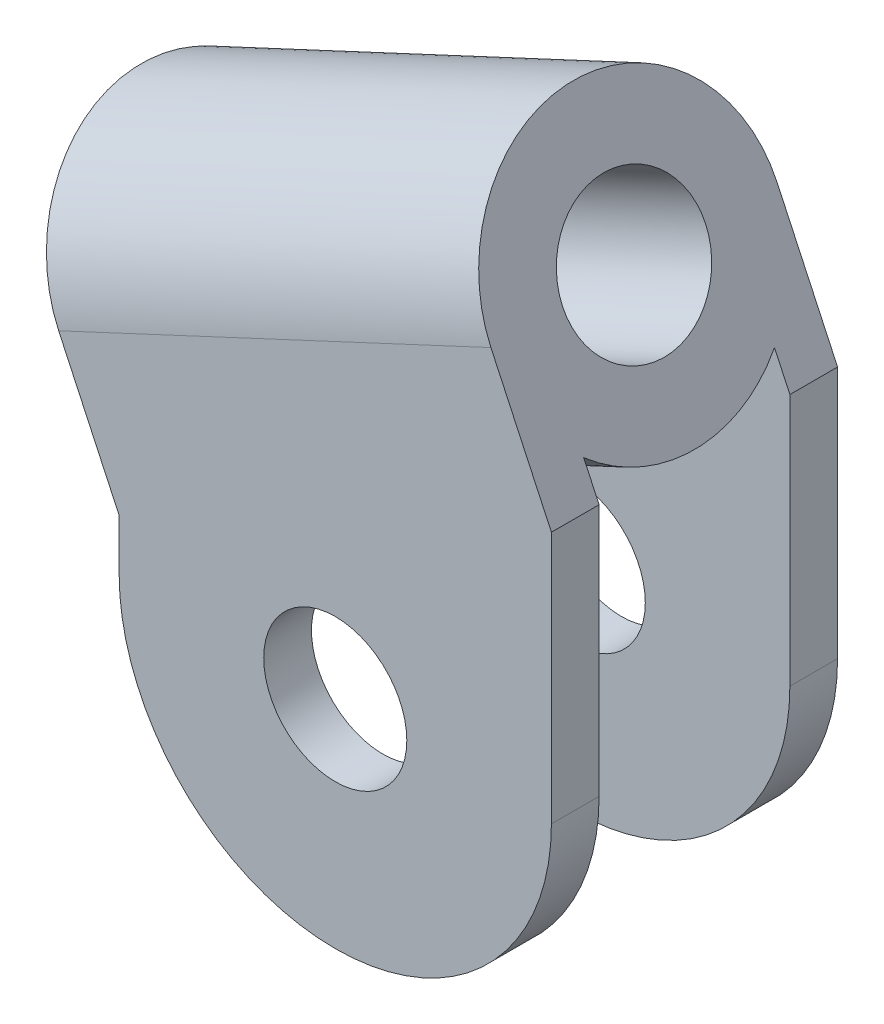
ISO-10303-21;
HEADER;
FILE_DESCRIPTION(('STEP AP214'),'2;1');
FILE_NAME('part.step','',(''),(''),'','','');
FILE_SCHEMA(('AUTOMOTIVE_DESIGN { 1 0 10303 214 1 1 1 1 }'));
ENDSEC;
DATA;
#1=APPLICATION_CONTEXT('core data for automotive mechanical design processes');
#2=APPLICATION_PROTOCOL_DEFINITION('international standard','automotive_design',2000,#1);
#3=PRODUCT_CONTEXT('',#1,'mechanical');
#4=PRODUCT('Part','Part','',(#3));
#5=PRODUCT_RELATED_PRODUCT_CATEGORY('part','',(#4));
#6=PRODUCT_DEFINITION_FORMATION('','',#4);
#7=PRODUCT_DEFINITION_CONTEXT('part definition',#1,'design');
#8=PRODUCT_DEFINITION('design','',#6,#7);
#9=PRODUCT_DEFINITION_SHAPE('','',#8);
#10=(LENGTH_UNIT() NAMED_UNIT(*) SI_UNIT(.MILLI.,.METRE.));
#11=(NAMED_UNIT(*) PLANE_ANGLE_UNIT() SI_UNIT($,.RADIAN.));
#12=(NAMED_UNIT(*) SI_UNIT($,.STERADIAN.) SOLID_ANGLE_UNIT());
#13=UNCERTAINTY_MEASURE_WITH_UNIT(LENGTH_MEASURE(1.E-05),#10,'distance_accuracy_value','');
#14=(GEOMETRIC_REPRESENTATION_CONTEXT(3) GLOBAL_UNCERTAINTY_ASSIGNED_CONTEXT((#13)) GLOBAL_UNIT_ASSIGNED_CONTEXT((#10,
#11,#12)) REPRESENTATION_CONTEXT('',''));
#15=CARTESIAN_POINT('',(0.,0.,0.));
#16=DIRECTION('',(0.,0.,1.));
#17=DIRECTION('',(1.,0.,0.));
#18=AXIS2_PLACEMENT_3D('',#15,#16,#17);
#19=CARTESIAN_POINT('',(0.,0.,0.));
#20=DIRECTION('',(-0.906307787036649,-0.422618261740701,0.));
#21=DIRECTION('',(0.422618261740701,-0.906307787036649,0.));
#22=AXIS2_PLACEMENT_3D('',#19,#20,#21);
#23=CYLINDRICAL_SURFACE('',#22,30.);
#24=DIRECTION('',(-0.906307787036649,-0.422618261740701,0.));
#25=VECTOR('',#24,1.);
#26=CARTESIAN_POINT('',(9.45003161785004,-20.2656582035135,-20.));
#27=LINE('',#26,#25);
#28=CARTESIAN_POINT('',(9.45003161785002,-20.2656582035135,-20.));
#29=VERTEX_POINT('',#28);
#30=CARTESIAN_POINT('',(100.080810321515,21.9961679705566,-20.));
#31=VERTEX_POINT('',#30);
#32=EDGE_CURVE('E148',#29,#31,#27,.F.);
#33=ORIENTED_EDGE('',*,*,#32,.T.);
#34=CARTESIAN_POINT('',(90.6307787036649,42.2618261740701,0.));
#35=DIRECTION('',(-0.906307787036649,-0.422618261740701,0.));
#36=DIRECTION('',(0.422618261740701,-0.906307787036649,0.));
#37=AXIS2_PLACEMENT_3D('',#34,#35,#36);
#38=CIRCLE('',#37,30.);
#39=CARTESIAN_POINT('',(100.080810321515,21.9961679705566,20.));
#40=VERTEX_POINT('',#39);
#41=EDGE_CURVE('E55',#31,#40,#38,.T.);
#42=ORIENTED_EDGE('',*,*,#41,.T.);
#43=DIRECTION('',(-0.906307787036649,-0.422618261740701,0.));
#44=VECTOR('',#43,1.);
#45=CARTESIAN_POINT('',(9.45003161785004,-20.2656582035135,20.));
#46=LINE('',#45,#44);
#47=CARTESIAN_POINT('',(9.45003161785002,-20.2656582035135,20.));
#48=VERTEX_POINT('',#47);
#49=EDGE_CURVE('E220',#40,#48,#46,.T.);
#50=ORIENTED_EDGE('',*,*,#49,.T.);
#51=CARTESIAN_POINT('',(0.,0.,0.));
#52=DIRECTION('',(-0.906307787036649,-0.422618261740701,0.));
#53=DIRECTION('',(0.422618261740701,-0.906307787036649,0.));
#54=AXIS2_PLACEMENT_3D('',#51,#52,#53);
#55=CIRCLE('',#54,30.);
#56=EDGE_CURVE('E63',#29,#48,#55,.T.);
#57=ORIENTED_EDGE('',*,*,#56,.F.);
#58=EDGE_LOOP('',(#33,#42,#50,#57));
#59=FACE_BOUND('',#58,.T.);
#60=ADVANCED_FACE('F45',(#59),#23,.T.);
#61=CARTESIAN_POINT('',(90.6307787036649,42.2618261740701,30.));
#62=VERTEX_POINT('',#61);
#63=CARTESIAN_POINT('',(90.6307787036649,42.2618261740701,-30.));
#64=VERTEX_POINT('',#63);
#65=EDGE_CURVE('E11',#62,#64,#38,.T.);
#66=ORIENTED_EDGE('',*,*,#65,.T.);
#67=DIRECTION('',(-0.906307787036649,-0.422618261740701,0.));
#68=VECTOR('',#67,1.);
#69=CARTESIAN_POINT('',(0.,0.,-30.));
#70=LINE('',#69,#68);
#71=CARTESIAN_POINT('',(0.,0.,-30.));
#72=VERTEX_POINT('',#71);
#73=EDGE_CURVE('E70',#72,#64,#70,.F.);
#74=ORIENTED_EDGE('',*,*,#73,.F.);
#75=CARTESIAN_POINT('',(0.,0.,30.));
#76=VERTEX_POINT('',#75);
#77=EDGE_CURVE('E161',#76,#72,#55,.T.);
#78=ORIENTED_EDGE('',*,*,#77,.F.);
#79=DIRECTION('',(-0.906307787036649,-0.422618261740701,0.));
#80=VECTOR('',#79,1.);
#81=CARTESIAN_POINT('',(0.,0.,30.));
#82=LINE('',#81,#80);
#83=EDGE_CURVE('E223',#76,#62,#82,.F.);
#84=ORIENTED_EDGE('',*,*,#83,.T.);
#85=EDGE_LOOP('',(#66,#74,#78,#84));
#86=FACE_BOUND('',#85,.T.);
#87=ADVANCED_FACE('F327',(#86),#23,.T.);
#88=CARTESIAN_POINT('',(-12.678547852221,27.1892336110994,0.));
#89=DIRECTION('',(0.906307787036649,0.422618261740701,0.));
#90=DIRECTION('',(-0.422618261740701,0.906307787036649,0.));
#91=AXIS2_PLACEMENT_3D('',#88,#89,#90);
#92=PLANE('',#91);
#93=CARTESIAN_POINT('',(0.,0.,0.));
#94=DIRECTION('',(0.906307787036649,0.422618261740701,0.));
#95=DIRECTION('',(-0.422618261740701,0.906307787036649,0.));
#96=AXIS2_PLACEMENT_3D('',#93,#94,#95);
#97=CIRCLE('',#96,15.);
#98=CARTESIAN_POINT('',(-6.33927392611052,13.5946168055497,0.));
#99=VERTEX_POINT('',#98);
#100=EDGE_CURVE('E242',#99,#99,#97,.T.);
#101=ORIENTED_EDGE('',*,*,#100,.T.);
#102=EDGE_LOOP('',(#101));
#103=FACE_BOUND('',#102,.T.);
#104=ORIENTED_EDGE('',*,*,#77,.T.);
#105=DIRECTION('',(0.422618261740701,-0.906307787036649,0.));
#106=VECTOR('',#105,1.);
#107=CARTESIAN_POINT('',(-28.8663280289911,61.9040402278701,-30.));
#108=LINE('',#107,#106);
#109=CARTESIAN_POINT('',(12.678547852221,-27.1892336110995,-30.));
#110=VERTEX_POINT('',#109);
#111=EDGE_CURVE('E147',#72,#110,#108,.T.);
#112=ORIENTED_EDGE('',*,*,#111,.T.);
#113=DIRECTION('',(0.,0.,1.));
#114=VECTOR('',#113,1.);
#115=CARTESIAN_POINT('',(12.678547852221,-27.1892336110995,-30.));
#116=LINE('',#115,#114);
#117=CARTESIAN_POINT('',(12.678547852221,-27.1892336110995,-20.));
#118=VERTEX_POINT('',#117);
#119=EDGE_CURVE('E137',#110,#118,#116,.T.);
#120=ORIENTED_EDGE('',*,*,#119,.T.);
#121=DIRECTION('',(0.422618261740701,-0.906307787036649,0.));
#122=VECTOR('',#121,1.);
#123=CARTESIAN_POINT('',(-28.8663280289911,61.9040402278701,-20.));
#124=LINE('',#123,#122);
#125=EDGE_CURVE('E163',#29,#118,#124,.T.);
#126=ORIENTED_EDGE('',*,*,#125,.F.);
#127=ORIENTED_EDGE('',*,*,#56,.T.);
#128=DIRECTION('',(0.422618261740701,-0.906307787036649,0.));
#129=VECTOR('',#128,1.);
#130=CARTESIAN_POINT('',(-28.8663280289911,61.9040402278701,20.));
#131=LINE('',#130,#129);
#132=CARTESIAN_POINT('',(12.678547852221,-27.1892336110995,20.));
#133=VERTEX_POINT('',#132);
#134=EDGE_CURVE('E214',#48,#133,#131,.T.);
#135=ORIENTED_EDGE('',*,*,#134,.T.);
#136=DIRECTION('',(0.,0.,1.));
#137=VECTOR('',#136,1.);
#138=CARTESIAN_POINT('',(12.678547852221,-27.1892336110995,20.));
#139=LINE('',#138,#137);
#140=CARTESIAN_POINT('',(12.678547852221,-27.1892336110995,30.));
#141=VERTEX_POINT('',#140);
#142=EDGE_CURVE('E209',#133,#141,#139,.T.);
#143=ORIENTED_EDGE('',*,*,#142,.T.);
#144=DIRECTION('',(0.422618261740701,-0.906307787036649,0.));
#145=VECTOR('',#144,1.);
#146=CARTESIAN_POINT('',(-28.8663280289911,61.9040402278701,30.));
#147=LINE('',#146,#145);
#148=EDGE_CURVE('E213',#76,#141,#147,.T.);
#149=ORIENTED_EDGE('',*,*,#148,.F.);
#150=EDGE_LOOP('',(#104,#112,#120,#126,#127,#135,#143,#149));
#151=FACE_BOUND('',#150,.T.);
#152=ADVANCED_FACE('F47',(#103,#151),#92,.F.);
#153=CARTESIAN_POINT('',(90.6307787036649,42.2618261740701,0.));
#154=DIRECTION('',(-0.906307787036649,-0.422618261740701,0.));
#155=DIRECTION('',(0.422618261740701,-0.906307787036649,0.));
#156=AXIS2_PLACEMENT_3D('',#153,#154,#155);
#157=PLANE('',#156);
#158=CARTESIAN_POINT('',(90.6307787036649,42.2618261740701,0.));
#159=DIRECTION('',(-0.906307787036649,-0.422618261740701,0.));
#160=DIRECTION('',(0.422618261740701,-0.906307787036649,0.));
#161=AXIS2_PLACEMENT_3D('',#158,#159,#160);
#162=CIRCLE('',#161,15.);
#163=CARTESIAN_POINT('',(96.9700526297754,28.6672093685203,0.));
#164=VERTEX_POINT('',#163);
#165=EDGE_CURVE('E239',#164,#164,#162,.T.);
#166=ORIENTED_EDGE('',*,*,#165,.T.);
#167=EDGE_LOOP('',(#166));
#168=FACE_BOUND('',#167,.T.);
#169=ORIENTED_EDGE('',*,*,#65,.F.);
#170=DIRECTION('',(0.422618261740701,-0.906307787036649,0.));
#171=VECTOR('',#170,1.);
#172=CARTESIAN_POINT('',(61.7644506746738,104.16586640194,30.));
#173=LINE('',#172,#171);
#174=CARTESIAN_POINT('',(103.309326555886,15.0725925629706,30.));
#175=VERTEX_POINT('',#174);
#176=EDGE_CURVE('E208',#62,#175,#173,.T.);
#177=ORIENTED_EDGE('',*,*,#176,.T.);
#178=DIRECTION('',(0.,0.,-1.));
#179=VECTOR('',#178,1.);
#180=CARTESIAN_POINT('',(103.309326555886,15.0725925629706,30.));
#181=LINE('',#180,#179);
#182=CARTESIAN_POINT('',(103.309326555886,15.0725925629706,20.));
#183=VERTEX_POINT('',#182);
#184=EDGE_CURVE('E215',#175,#183,#181,.T.);
#185=ORIENTED_EDGE('',*,*,#184,.T.);
#186=DIRECTION('',(0.422618261740701,-0.906307787036649,0.));
#187=VECTOR('',#186,1.);
#188=CARTESIAN_POINT('',(61.7644506746738,104.16586640194,20.));
#189=LINE('',#188,#187);
#190=EDGE_CURVE('E219',#40,#183,#189,.T.);
#191=ORIENTED_EDGE('',*,*,#190,.F.);
#192=ORIENTED_EDGE('',*,*,#41,.F.);
#193=DIRECTION('',(0.422618261740701,-0.906307787036649,0.));
#194=VECTOR('',#193,1.);
#195=CARTESIAN_POINT('',(61.7644506746738,104.16586640194,-20.));
#196=LINE('',#195,#194);
#197=CARTESIAN_POINT('',(103.309326555886,15.0725925629706,-20.));
#198=VERTEX_POINT('',#197);
#199=EDGE_CURVE('E180',#31,#198,#196,.T.);
#200=ORIENTED_EDGE('',*,*,#199,.T.);
#201=DIRECTION('',(0.,0.,-1.));
#202=VECTOR('',#201,1.);
#203=CARTESIAN_POINT('',(103.309326555886,15.0725925629706,-20.));
#204=LINE('',#203,#202);
#205=CARTESIAN_POINT('',(103.309326555886,15.0725925629706,-30.));
#206=VERTEX_POINT('',#205);
#207=EDGE_CURVE('E166',#198,#206,#204,.T.);
#208=ORIENTED_EDGE('',*,*,#207,.T.);
#209=DIRECTION('',(0.422618261740701,-0.906307787036649,0.));
#210=VECTOR('',#209,1.);
#211=CARTESIAN_POINT('',(61.7644506746738,104.16586640194,-30.));
#212=LINE('',#211,#210);
#213=EDGE_CURVE('E173',#64,#206,#212,.T.);
#214=ORIENTED_EDGE('',*,*,#213,.F.);
#215=EDGE_LOOP('',(#169,#177,#185,#191,#192,#200,#208,#214));
#216=FACE_BOUND('',#215,.T.);
#217=ADVANCED_FACE('F285',(#168,#216),#157,.F.);
#218=CARTESIAN_POINT('',(61.7644506746738,104.16586640194,20.));
#219=DIRECTION('',(0.,0.,1.));
#220=DIRECTION('',(1.,0.,0.));
#221=AXIS2_PLACEMENT_3D('',#218,#219,#220);
#222=PLANE('',#221);
#223=CARTESIAN_POINT('',(57.9939372040534,-37.8883191704714,20.));
#224=DIRECTION('',(0.,0.,1.));
#225=DIRECTION('',(1.,0.,0.));
#226=AXIS2_PLACEMENT_3D('',#223,#224,#225);
#227=CIRCLE('',#226,15.);
#228=CARTESIAN_POINT('',(72.9939372040535,-37.8883191704714,20.));
#229=VERTEX_POINT('',#228);
#230=EDGE_CURVE('E243',#229,#229,#227,.T.);
#231=ORIENTED_EDGE('',*,*,#230,.T.);
#232=EDGE_LOOP('',(#231));
#233=FACE_BOUND('',#232,.T.);
#234=ORIENTED_EDGE('',*,*,#49,.F.);
#235=ORIENTED_EDGE('',*,*,#190,.T.);
#236=DIRECTION('',(0.,1.,0.));
#237=VECTOR('',#236,1.);
#238=CARTESIAN_POINT('',(103.309326555886,0.,20.));
#239=LINE('',#238,#237);
#240=CARTESIAN_POINT('',(103.309326555886,-37.8883191704714,20.));
#241=VERTEX_POINT('',#240);
#242=EDGE_CURVE('E186',#241,#183,#239,.T.);
#243=ORIENTED_EDGE('',*,*,#242,.F.);
#244=CARTESIAN_POINT('',(57.9939372040534,-37.8883191704714,20.));
#245=DIRECTION('',(0.,0.,1.));
#246=DIRECTION('',(1.,0.,0.));
#247=AXIS2_PLACEMENT_3D('',#244,#245,#246);
#248=CIRCLE('',#247,45.3153893518324);
#249=CARTESIAN_POINT('',(12.678547852221,-37.8883191704714,20.));
#250=VERTEX_POINT('',#249);
#251=EDGE_CURVE('E196',#250,#241,#248,.T.);
#252=ORIENTED_EDGE('',*,*,#251,.F.);
#253=DIRECTION('',(0.,-1.,0.));
#254=VECTOR('',#253,1.);
#255=CARTESIAN_POINT('',(12.678547852221,0.,20.));
#256=LINE('',#255,#254);
#257=EDGE_CURVE('E172',#133,#250,#256,.T.);
#258=ORIENTED_EDGE('',*,*,#257,.F.);
#259=ORIENTED_EDGE('',*,*,#134,.F.);
#260=EDGE_LOOP('',(#234,#235,#243,#252,#258,#259));
#261=FACE_BOUND('',#260,.T.);
#262=ADVANCED_FACE('F309',(#233,#261),#222,.F.);
#263=CARTESIAN_POINT('',(-28.8663280289911,61.9040402278701,30.));
#264=DIRECTION('',(0.,0.,-1.));
#265=DIRECTION('',(-1.,0.,0.));
#266=AXIS2_PLACEMENT_3D('',#263,#264,#265);
#267=PLANE('',#266);
#268=CARTESIAN_POINT('',(57.9939372040534,-37.8883191704714,30.));
#269=DIRECTION('',(0.,0.,-1.));
#270=DIRECTION('',(-1.,0.,0.));
#271=AXIS2_PLACEMENT_3D('',#268,#269,#270);
#272=CIRCLE('',#271,15.);
#273=CARTESIAN_POINT('',(42.9939372040534,-37.8883191704714,30.));
#274=VERTEX_POINT('',#273);
#275=EDGE_CURVE('E251',#274,#274,#272,.T.);
#276=ORIENTED_EDGE('',*,*,#275,.T.);
#277=EDGE_LOOP('',(#276));
#278=FACE_BOUND('',#277,.T.);
#279=ORIENTED_EDGE('',*,*,#83,.F.);
#280=ORIENTED_EDGE('',*,*,#148,.T.);
#281=DIRECTION('',(0.,-1.,0.));
#282=VECTOR('',#281,1.);
#283=CARTESIAN_POINT('',(12.678547852221,0.,30.));
#284=LINE('',#283,#282);
#285=CARTESIAN_POINT('',(12.678547852221,-37.8883191704714,30.));
#286=VERTEX_POINT('',#285);
#287=EDGE_CURVE('E181',#141,#286,#284,.T.);
#288=ORIENTED_EDGE('',*,*,#287,.T.);
#289=CARTESIAN_POINT('',(57.9939372040534,-37.8883191704714,30.));
#290=DIRECTION('',(0.,0.,1.));
#291=DIRECTION('',(1.,0.,0.));
#292=AXIS2_PLACEMENT_3D('',#289,#290,#291);
#293=CIRCLE('',#292,45.3153893518324);
#294=CARTESIAN_POINT('',(103.309326555886,-37.8883191704714,30.));
#295=VERTEX_POINT('',#294);
#296=EDGE_CURVE('E185',#286,#295,#293,.T.);
#297=ORIENTED_EDGE('',*,*,#296,.T.);
#298=DIRECTION('',(0.,1.,0.));
#299=VECTOR('',#298,1.);
#300=CARTESIAN_POINT('',(103.309326555886,0.,30.));
#301=LINE('',#300,#299);
#302=EDGE_CURVE('E189',#295,#175,#301,.T.);
#303=ORIENTED_EDGE('',*,*,#302,.T.);
#304=ORIENTED_EDGE('',*,*,#176,.F.);
#305=EDGE_LOOP('',(#279,#280,#288,#297,#303,#304));
#306=FACE_BOUND('',#305,.T.);
#307=ADVANCED_FACE('F299',(#278,#306),#267,.F.);
#308=CARTESIAN_POINT('',(12.678547852221,0.,30.));
#309=DIRECTION('',(1.,0.,0.));
#310=DIRECTION('',(0.,1.,0.));
#311=AXIS2_PLACEMENT_3D('',#308,#309,#310);
#312=PLANE('',#311);
#313=ORIENTED_EDGE('',*,*,#257,.T.);
#314=DIRECTION('',(0.,0.,-1.));
#315=VECTOR('',#314,1.);
#316=CARTESIAN_POINT('',(12.678547852221,-37.8883191704714,30.));
#317=LINE('',#316,#315);
#318=EDGE_CURVE('E204',#286,#250,#317,.T.);
#319=ORIENTED_EDGE('',*,*,#318,.F.);
#320=ORIENTED_EDGE('',*,*,#287,.F.);
#321=ORIENTED_EDGE('',*,*,#142,.F.);
#322=EDGE_LOOP('',(#313,#319,#320,#321));
#323=FACE_BOUND('',#322,.T.);
#324=ADVANCED_FACE('F314',(#323),#312,.F.);
#325=CARTESIAN_POINT('',(57.9939372040534,-37.8883191704714,30.));
#326=DIRECTION('',(0.,0.,-1.));
#327=DIRECTION('',(-1.,0.,0.));
#328=AXIS2_PLACEMENT_3D('',#325,#326,#327);
#329=CYLINDRICAL_SURFACE('',#328,45.3153893518324);
#330=ORIENTED_EDGE('',*,*,#251,.T.);
#331=DIRECTION('',(0.,0.,-1.));
#332=VECTOR('',#331,1.);
#333=CARTESIAN_POINT('',(103.309326555886,-37.8883191704714,30.));
#334=LINE('',#333,#332);
#335=EDGE_CURVE('E192',#295,#241,#334,.T.);
#336=ORIENTED_EDGE('',*,*,#335,.F.);
#337=ORIENTED_EDGE('',*,*,#296,.F.);
#338=ORIENTED_EDGE('',*,*,#318,.T.);
#339=EDGE_LOOP('',(#330,#336,#337,#338));
#340=FACE_BOUND('',#339,.T.);
#341=ADVANCED_FACE('F317',(#340),#329,.T.);
#342=CARTESIAN_POINT('',(103.309326555886,0.,30.));
#343=DIRECTION('',(-1.,0.,0.));
#344=DIRECTION('',(0.,0.,1.));
#345=AXIS2_PLACEMENT_3D('',#342,#343,#344);
#346=PLANE('',#345);
#347=ORIENTED_EDGE('',*,*,#242,.T.);
#348=ORIENTED_EDGE('',*,*,#184,.F.);
#349=ORIENTED_EDGE('',*,*,#302,.F.);
#350=ORIENTED_EDGE('',*,*,#335,.T.);
#351=EDGE_LOOP('',(#347,#348,#349,#350));
#352=FACE_BOUND('',#351,.T.);
#353=ADVANCED_FACE('F304',(#352),#346,.F.);
#354=CARTESIAN_POINT('',(61.7644506746738,104.16586640194,-30.));
#355=DIRECTION('',(0.,0.,1.));
#356=DIRECTION('',(1.,0.,0.));
#357=AXIS2_PLACEMENT_3D('',#354,#355,#356);
#358=PLANE('',#357);
#359=CARTESIAN_POINT('',(57.9939372040534,-37.8883191704714,-30.));
#360=DIRECTION('',(0.,0.,1.));
#361=DIRECTION('',(1.,0.,0.));
#362=AXIS2_PLACEMENT_3D('',#359,#360,#361);
#363=CIRCLE('',#362,15.);
#364=CARTESIAN_POINT('',(72.9939372040535,-37.8883191704714,-30.));
#365=VERTEX_POINT('',#364);
#366=EDGE_CURVE('E373',#365,#365,#363,.T.);
#367=ORIENTED_EDGE('',*,*,#366,.T.);
#368=EDGE_LOOP('',(#367));
#369=FACE_BOUND('',#368,.T.);
#370=ORIENTED_EDGE('',*,*,#111,.F.);
#371=ORIENTED_EDGE('',*,*,#73,.T.);
#372=ORIENTED_EDGE('',*,*,#213,.T.);
#373=DIRECTION('',(0.,1.,0.));
#374=VECTOR('',#373,1.);
#375=CARTESIAN_POINT('',(103.309326555886,-37.8883191704714,-30.));
#376=LINE('',#375,#374);
#377=CARTESIAN_POINT('',(103.309326555886,-37.8883191704714,-30.));
#378=VERTEX_POINT('',#377);
#379=EDGE_CURVE('E262',#378,#206,#376,.T.);
#380=ORIENTED_EDGE('',*,*,#379,.F.);
#381=CARTESIAN_POINT('',(57.9939372040534,-37.8883191704714,-30.));
#382=DIRECTION('',(0.,0.,1.));
#383=DIRECTION('',(1.,0.,0.));
#384=AXIS2_PLACEMENT_3D('',#381,#382,#383);
#385=CIRCLE('',#384,45.3153893518324);
#386=CARTESIAN_POINT('',(12.678547852221,-37.8883191704714,-30.));
#387=VERTEX_POINT('',#386);
#388=EDGE_CURVE('E156',#387,#378,#385,.T.);
#389=ORIENTED_EDGE('',*,*,#388,.F.);
#390=DIRECTION('',(0.,-1.,0.));
#391=VECTOR('',#390,1.);
#392=CARTESIAN_POINT('',(12.678547852221,-27.1892336110995,-30.));
#393=LINE('',#392,#391);
#394=EDGE_CURVE('E140',#110,#387,#393,.T.);
#395=ORIENTED_EDGE('',*,*,#394,.F.);
#396=EDGE_LOOP('',(#370,#371,#372,#380,#389,#395));
#397=FACE_BOUND('',#396,.T.);
#398=ADVANCED_FACE('F153',(#369,#397),#358,.F.);
#399=CARTESIAN_POINT('',(-28.8663280289911,61.9040402278701,-20.));
#400=DIRECTION('',(0.,0.,-1.));
#401=DIRECTION('',(-1.,0.,0.));
#402=AXIS2_PLACEMENT_3D('',#399,#400,#401);
#403=PLANE('',#402);
#404=CARTESIAN_POINT('',(57.9939372040534,-37.8883191704714,-20.));
#405=DIRECTION('',(0.,0.,-1.));
#406=DIRECTION('',(-1.,0.,0.));
#407=AXIS2_PLACEMENT_3D('',#404,#405,#406);
#408=CIRCLE('',#407,15.);
#409=CARTESIAN_POINT('',(42.9939372040534,-37.8883191704714,-20.));
#410=VERTEX_POINT('',#409);
#411=EDGE_CURVE('E49',#410,#410,#408,.T.);
#412=ORIENTED_EDGE('',*,*,#411,.T.);
#413=EDGE_LOOP('',(#412));
#414=FACE_BOUND('',#413,.T.);
#415=ORIENTED_EDGE('',*,*,#32,.F.);
#416=ORIENTED_EDGE('',*,*,#125,.T.);
#417=DIRECTION('',(0.,-1.,0.));
#418=VECTOR('',#417,1.);
#419=CARTESIAN_POINT('',(12.678547852221,-27.1892336110995,-20.));
#420=LINE('',#419,#418);
#421=CARTESIAN_POINT('',(12.678547852221,-37.8883191704714,-20.));
#422=VERTEX_POINT('',#421);
#423=EDGE_CURVE('E142',#118,#422,#420,.T.);
#424=ORIENTED_EDGE('',*,*,#423,.T.);
#425=CARTESIAN_POINT('',(57.9939372040534,-37.8883191704714,-20.));
#426=DIRECTION('',(0.,0.,1.));
#427=DIRECTION('',(1.,0.,0.));
#428=AXIS2_PLACEMENT_3D('',#425,#426,#427);
#429=CIRCLE('',#428,45.3153893518324);
#430=CARTESIAN_POINT('',(103.309326555886,-37.8883191704714,-20.));
#431=VERTEX_POINT('',#430);
#432=EDGE_CURVE('E268',#422,#431,#429,.T.);
#433=ORIENTED_EDGE('',*,*,#432,.T.);
#434=DIRECTION('',(0.,1.,0.));
#435=VECTOR('',#434,1.);
#436=CARTESIAN_POINT('',(103.309326555886,-37.8883191704714,-20.));
#437=LINE('',#436,#435);
#438=EDGE_CURVE('E158',#431,#198,#437,.T.);
#439=ORIENTED_EDGE('',*,*,#438,.T.);
#440=ORIENTED_EDGE('',*,*,#199,.F.);
#441=EDGE_LOOP('',(#415,#416,#424,#433,#439,#440));
#442=FACE_BOUND('',#441,.T.);
#443=ADVANCED_FACE('F291',(#414,#442),#403,.F.);
#444=CARTESIAN_POINT('',(103.309326555886,-37.8883191704714,-30.));
#445=DIRECTION('',(1.,0.,0.));
#446=DIRECTION('',(0.,0.,-1.));
#447=AXIS2_PLACEMENT_3D('',#444,#445,#446);
#448=PLANE('',#447);
#449=ORIENTED_EDGE('',*,*,#438,.F.);
#450=DIRECTION('',(0.,0.,1.));
#451=VECTOR('',#450,1.);
#452=CARTESIAN_POINT('',(103.309326555886,-37.8883191704714,-30.));
#453=LINE('',#452,#451);
#454=EDGE_CURVE('E175',#378,#431,#453,.T.);
#455=ORIENTED_EDGE('',*,*,#454,.F.);
#456=ORIENTED_EDGE('',*,*,#379,.T.);
#457=ORIENTED_EDGE('',*,*,#207,.F.);
#458=EDGE_LOOP('',(#449,#455,#456,#457));
#459=FACE_BOUND('',#458,.T.);
#460=ADVANCED_FACE('F295',(#459),#448,.T.);
#461=CARTESIAN_POINT('',(57.9939372040534,-37.8883191704714,-30.));
#462=DIRECTION('',(0.,0.,1.));
#463=DIRECTION('',(1.,0.,0.));
#464=AXIS2_PLACEMENT_3D('',#461,#462,#463);
#465=CYLINDRICAL_SURFACE('',#464,45.3153893518324);
#466=ORIENTED_EDGE('',*,*,#432,.F.);
#467=DIRECTION('',(0.,0.,1.));
#468=VECTOR('',#467,1.);
#469=CARTESIAN_POINT('',(12.678547852221,-37.8883191704714,-30.));
#470=LINE('',#469,#468);
#471=EDGE_CURVE('E265',#387,#422,#470,.T.);
#472=ORIENTED_EDGE('',*,*,#471,.F.);
#473=ORIENTED_EDGE('',*,*,#388,.T.);
#474=ORIENTED_EDGE('',*,*,#454,.T.);
#475=EDGE_LOOP('',(#466,#472,#473,#474));
#476=FACE_BOUND('',#475,.T.);
#477=ADVANCED_FACE('F356',(#476),#465,.T.);
#478=CARTESIAN_POINT('',(12.678547852221,-27.1892336110995,-30.));
#479=DIRECTION('',(-1.,0.,0.));
#480=DIRECTION('',(0.,-1.,0.));
#481=AXIS2_PLACEMENT_3D('',#478,#479,#480);
#482=PLANE('',#481);
#483=ORIENTED_EDGE('',*,*,#423,.F.);
#484=ORIENTED_EDGE('',*,*,#119,.F.);
#485=ORIENTED_EDGE('',*,*,#394,.T.);
#486=ORIENTED_EDGE('',*,*,#471,.T.);
#487=EDGE_LOOP('',(#483,#484,#485,#486));
#488=FACE_BOUND('',#487,.T.);
#489=ADVANCED_FACE('F139',(#488),#482,.T.);
#490=CARTESIAN_POINT('',(-42.2829499404244,-19.7168633666044,0.));
#491=DIRECTION('',(0.906307787036649,0.422618261740701,0.));
#492=DIRECTION('',(-0.422618261740701,0.906307787036649,0.));
#493=AXIS2_PLACEMENT_3D('',#490,#491,#492);
#494=CYLINDRICAL_SURFACE('',#493,15.);
#495=ORIENTED_EDGE('',*,*,#165,.F.);
#496=EDGE_LOOP('',(#495));
#497=FACE_BOUND('',#496,.T.);
#498=ORIENTED_EDGE('',*,*,#100,.F.);
#499=EDGE_LOOP('',(#498));
#500=FACE_BOUND('',#499,.T.);
#501=ADVANCED_FACE('F344',(#497,#500),#494,.F.);
#502=CARTESIAN_POINT('',(57.9939372040534,-37.8883191704714,-30.));
#503=DIRECTION('',(0.,0.,1.));
#504=DIRECTION('',(1.,0.,0.));
#505=AXIS2_PLACEMENT_3D('',#502,#503,#504);
#506=CYLINDRICAL_SURFACE('',#505,15.);
#507=ORIENTED_EDGE('',*,*,#366,.F.);
#508=EDGE_LOOP('',(#507));
#509=FACE_BOUND('',#508,.T.);
#510=ORIENTED_EDGE('',*,*,#411,.F.);
#511=EDGE_LOOP('',(#510));
#512=FACE_BOUND('',#511,.T.);
#513=ADVANCED_FACE('F346',(#509,#512),#506,.F.);
#514=ORIENTED_EDGE('',*,*,#275,.F.);
#515=EDGE_LOOP('',(#514));
#516=FACE_BOUND('',#515,.T.);
#517=ORIENTED_EDGE('',*,*,#230,.F.);
#518=EDGE_LOOP('',(#517));
#519=FACE_BOUND('',#518,.T.);
#520=ADVANCED_FACE('F353',(#516,#519),#506,.F.);
#521=CLOSED_SHELL('',(#60,#87,#152,#217,#262,#307,#324,#341,#353,#398,#443,#460,#477,#489,#501,
#513,#520));
#522=MANIFOLD_SOLID_BREP('B2',#521);
#523=ADVANCED_BREP_SHAPE_REPRESENTATION('',(#18,#522),#14);
#524=SHAPE_DEFINITION_REPRESENTATION(#9,#523);
ENDSEC;
END-ISO-10303-21;
